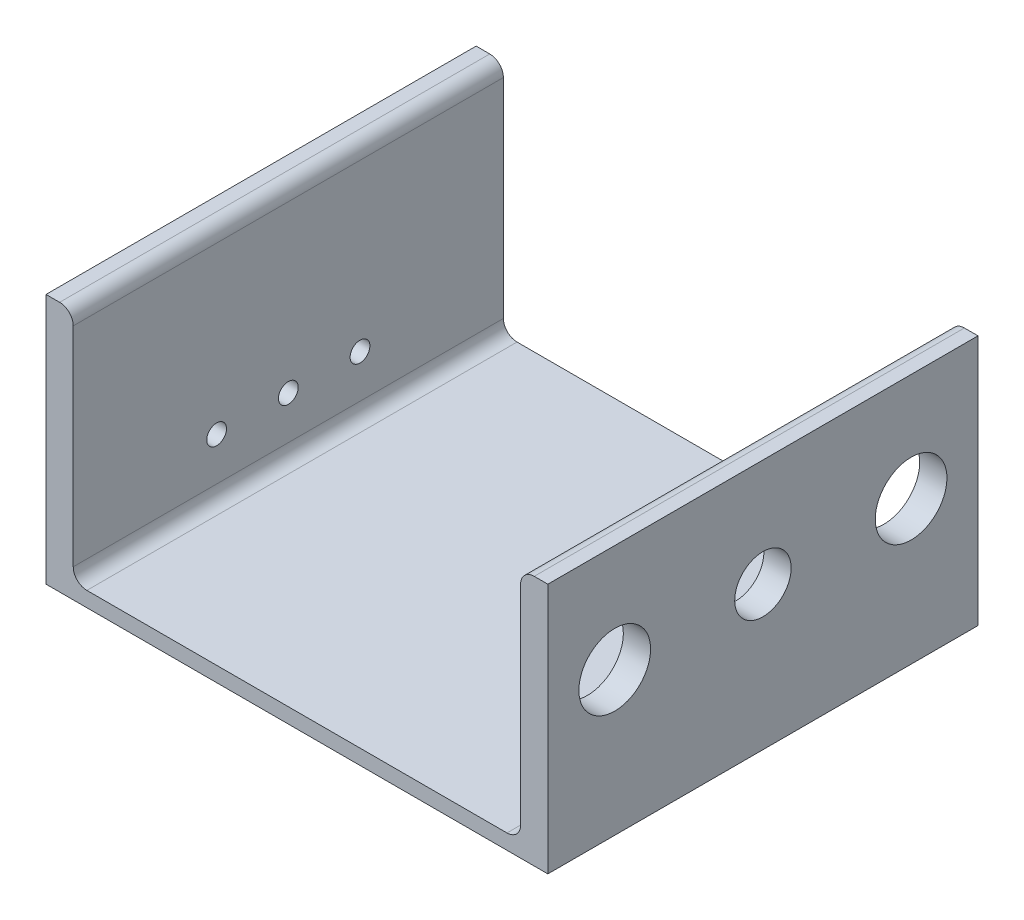
ISO-10303-21;
HEADER;
FILE_DESCRIPTION(('STEP AP214'),'2;1');
FILE_NAME('part.step','',(''),(''),'','','');
FILE_SCHEMA(('AUTOMOTIVE_DESIGN { 1 0 10303 214 1 1 1 1 }'));
ENDSEC;
DATA;
#1=APPLICATION_CONTEXT('core data for automotive mechanical design processes');
#2=APPLICATION_PROTOCOL_DEFINITION('international standard','automotive_design',2000,#1);
#3=PRODUCT_CONTEXT('',#1,'mechanical');
#4=PRODUCT('Part','Part','',(#3));
#5=PRODUCT_RELATED_PRODUCT_CATEGORY('part','',(#4));
#6=PRODUCT_DEFINITION_FORMATION('','',#4);
#7=PRODUCT_DEFINITION_CONTEXT('part definition',#1,'design');
#8=PRODUCT_DEFINITION('design','',#6,#7);
#9=PRODUCT_DEFINITION_SHAPE('','',#8);
#10=(LENGTH_UNIT() NAMED_UNIT(*) SI_UNIT(.MILLI.,.METRE.));
#11=(NAMED_UNIT(*) PLANE_ANGLE_UNIT() SI_UNIT($,.RADIAN.));
#12=(NAMED_UNIT(*) SI_UNIT($,.STERADIAN.) SOLID_ANGLE_UNIT());
#13=UNCERTAINTY_MEASURE_WITH_UNIT(LENGTH_MEASURE(1.E-05),#10,'distance_accuracy_value','');
#14=(GEOMETRIC_REPRESENTATION_CONTEXT(3) GLOBAL_UNCERTAINTY_ASSIGNED_CONTEXT((#13)) GLOBAL_UNIT_ASSIGNED_CONTEXT((#10,
#11,#12)) REPRESENTATION_CONTEXT('',''));
#15=CARTESIAN_POINT('',(0.,0.,0.));
#16=DIRECTION('',(0.,0.,1.));
#17=DIRECTION('',(1.,0.,0.));
#18=AXIS2_PLACEMENT_3D('',#15,#16,#17);
#19=CARTESIAN_POINT('',(-79.248,5.33399999999998,76.2));
#20=DIRECTION('',(-1.,0.,0.));
#21=DIRECTION('',(0.,-1.,0.));
#22=AXIS2_PLACEMENT_3D('',#19,#20,#21);
#23=PLANE('',#22);
#24=CARTESIAN_POINT('',(-79.248,25.4,25.4));
#25=DIRECTION('',(-1.,0.,0.));
#26=DIRECTION('',(0.,-1.,0.));
#27=AXIS2_PLACEMENT_3D('',#24,#25,#26);
#28=CIRCLE('',#27,3.5);
#29=CARTESIAN_POINT('',(-79.248,21.9,25.4));
#30=VERTEX_POINT('',#29);
#31=EDGE_CURVE('E317',#30,#30,#28,.F.);
#32=ORIENTED_EDGE('',*,*,#31,.F.);
#33=EDGE_LOOP('',(#32));
#34=FACE_BOUND('',#33,.T.);
#35=CARTESIAN_POINT('',(-79.248,25.4,-25.4));
#36=DIRECTION('',(-1.,0.,0.));
#37=DIRECTION('',(0.,-1.,0.));
#38=AXIS2_PLACEMENT_3D('',#35,#36,#37);
#39=CIRCLE('',#38,3.5);
#40=CARTESIAN_POINT('',(-79.248,21.9,-25.4));
#41=VERTEX_POINT('',#40);
#42=EDGE_CURVE('E316',#41,#41,#39,.F.);
#43=ORIENTED_EDGE('',*,*,#42,.F.);
#44=EDGE_LOOP('',(#43));
#45=FACE_BOUND('',#44,.T.);
#46=CARTESIAN_POINT('',(-79.248,25.4,0.));
#47=DIRECTION('',(-1.,0.,0.));
#48=DIRECTION('',(0.,-1.,0.));
#49=AXIS2_PLACEMENT_3D('',#46,#47,#48);
#50=CIRCLE('',#49,3.5);
#51=CARTESIAN_POINT('',(-79.248,21.9,0.));
#52=VERTEX_POINT('',#51);
#53=EDGE_CURVE('E294',#52,#52,#50,.F.);
#54=ORIENTED_EDGE('',*,*,#53,.F.);
#55=EDGE_LOOP('',(#54));
#56=FACE_BOUND('',#55,.T.);
#57=DIRECTION('',(0.,1.,0.));
#58=VECTOR('',#57,1.);
#59=CARTESIAN_POINT('',(-79.248,5.33399999999998,76.2));
#60=LINE('',#59,#58);
#61=CARTESIAN_POINT('',(-79.248,10.16,76.2));
#62=VERTEX_POINT('',#61);
#63=CARTESIAN_POINT('',(-79.248,84.074,76.2));
#64=VERTEX_POINT('',#63);
#65=EDGE_CURVE('E142',#62,#64,#60,.T.);
#66=ORIENTED_EDGE('',*,*,#65,.F.);
#67=DIRECTION('',(0.,0.,-1.));
#68=VECTOR('',#67,1.);
#69=CARTESIAN_POINT('',(-79.248,10.16,-76.2));
#70=LINE('',#69,#68);
#71=CARTESIAN_POINT('',(-79.248,10.16,-76.2));
#72=VERTEX_POINT('',#71);
#73=EDGE_CURVE('E218',#62,#72,#70,.T.);
#74=ORIENTED_EDGE('',*,*,#73,.T.);
#75=DIRECTION('',(0.,1.,0.));
#76=VECTOR('',#75,1.);
#77=CARTESIAN_POINT('',(-79.248,5.33399999999998,-76.2));
#78=LINE('',#77,#76);
#79=CARTESIAN_POINT('',(-79.248,84.074,-76.2));
#80=VERTEX_POINT('',#79);
#81=EDGE_CURVE('E180',#72,#80,#78,.T.);
#82=ORIENTED_EDGE('',*,*,#81,.T.);
#83=DIRECTION('',(0.,0.,-1.));
#84=VECTOR('',#83,1.);
#85=CARTESIAN_POINT('',(-79.248,84.074,76.2));
#86=LINE('',#85,#84);
#87=EDGE_CURVE('E152',#80,#64,#86,.F.);
#88=ORIENTED_EDGE('',*,*,#87,.T.);
#89=EDGE_LOOP('',(#66,#74,#82,#88));
#90=FACE_BOUND('',#89,.T.);
#91=ADVANCED_FACE('F43',(#34,#45,#56,#90),#23,.F.);
#92=CARTESIAN_POINT('',(-79.248,88.9,76.2));
#93=DIRECTION('',(0.,-1.,0.));
#94=DIRECTION('',(0.,0.,-1.));
#95=AXIS2_PLACEMENT_3D('',#92,#93,#94);
#96=PLANE('',#95);
#97=DIRECTION('',(-1.,0.,0.));
#98=VECTOR('',#97,1.);
#99=CARTESIAN_POINT('',(-79.248,88.9,76.2));
#100=LINE('',#99,#98);
#101=CARTESIAN_POINT('',(-84.074,88.9,76.2));
#102=VERTEX_POINT('',#101);
#103=CARTESIAN_POINT('',(-88.9,88.9,76.2));
#104=VERTEX_POINT('',#103);
#105=EDGE_CURVE('E132',#102,#104,#100,.T.);
#106=ORIENTED_EDGE('',*,*,#105,.F.);
#107=DIRECTION('',(0.,0.,-1.));
#108=VECTOR('',#107,1.);
#109=CARTESIAN_POINT('',(-84.074,88.9,76.2));
#110=LINE('',#109,#108);
#111=CARTESIAN_POINT('',(-84.074,88.9,-76.2));
#112=VERTEX_POINT('',#111);
#113=EDGE_CURVE('E249',#102,#112,#110,.T.);
#114=ORIENTED_EDGE('',*,*,#113,.T.);
#115=DIRECTION('',(-1.,0.,0.));
#116=VECTOR('',#115,1.);
#117=CARTESIAN_POINT('',(-79.248,88.9,-76.2));
#118=LINE('',#117,#116);
#119=CARTESIAN_POINT('',(-88.9,88.9,-76.2));
#120=VERTEX_POINT('',#119);
#121=EDGE_CURVE('E148',#112,#120,#118,.T.);
#122=ORIENTED_EDGE('',*,*,#121,.T.);
#123=DIRECTION('',(0.,0.,-1.));
#124=VECTOR('',#123,1.);
#125=CARTESIAN_POINT('',(-88.9,88.9,76.2));
#126=LINE('',#125,#124);
#127=EDGE_CURVE('E145',#104,#120,#126,.T.);
#128=ORIENTED_EDGE('',*,*,#127,.F.);
#129=EDGE_LOOP('',(#106,#114,#122,#128));
#130=FACE_BOUND('',#129,.T.);
#131=ADVANCED_FACE('F146',(#130),#96,.F.);
#132=CARTESIAN_POINT('',(-88.9,88.9,76.2));
#133=DIRECTION('',(1.,0.,0.));
#134=DIRECTION('',(0.,1.,0.));
#135=AXIS2_PLACEMENT_3D('',#132,#133,#134);
#136=PLANE('',#135);
#137=CARTESIAN_POINT('',(-88.9,25.4,25.4));
#138=DIRECTION('',(-1.,0.,0.));
#139=DIRECTION('',(0.,1.,0.));
#140=AXIS2_PLACEMENT_3D('',#137,#138,#139);
#141=CIRCLE('',#140,3.5);
#142=CARTESIAN_POINT('',(-88.9,28.9,25.4));
#143=VERTEX_POINT('',#142);
#144=EDGE_CURVE('E322',#143,#143,#141,.T.);
#145=ORIENTED_EDGE('',*,*,#144,.F.);
#146=EDGE_LOOP('',(#145));
#147=FACE_BOUND('',#146,.T.);
#148=CARTESIAN_POINT('',(-88.9,25.4,-25.4));
#149=DIRECTION('',(-1.,0.,0.));
#150=DIRECTION('',(0.,-1.,0.));
#151=AXIS2_PLACEMENT_3D('',#148,#149,#150);
#152=CIRCLE('',#151,3.5);
#153=CARTESIAN_POINT('',(-88.9,21.9,-25.4));
#154=VERTEX_POINT('',#153);
#155=EDGE_CURVE('E321',#154,#154,#152,.T.);
#156=ORIENTED_EDGE('',*,*,#155,.F.);
#157=EDGE_LOOP('',(#156));
#158=FACE_BOUND('',#157,.T.);
#159=CARTESIAN_POINT('',(-88.9,25.4,0.));
#160=DIRECTION('',(-1.,0.,0.));
#161=DIRECTION('',(0.,-1.,0.));
#162=AXIS2_PLACEMENT_3D('',#159,#160,#161);
#163=CIRCLE('',#162,3.5);
#164=CARTESIAN_POINT('',(-88.9,21.9,0.));
#165=VERTEX_POINT('',#164);
#166=EDGE_CURVE('E312',#165,#165,#163,.T.);
#167=ORIENTED_EDGE('',*,*,#166,.F.);
#168=EDGE_LOOP('',(#167));
#169=FACE_BOUND('',#168,.T.);
#170=DIRECTION('',(0.,-1.,0.));
#171=VECTOR('',#170,1.);
#172=CARTESIAN_POINT('',(-88.9,88.9,-76.2));
#173=LINE('',#172,#171);
#174=CARTESIAN_POINT('',(-88.9,0.,-76.2));
#175=VERTEX_POINT('',#174);
#176=EDGE_CURVE('E187',#120,#175,#173,.T.);
#177=ORIENTED_EDGE('',*,*,#176,.T.);
#178=DIRECTION('',(0.,0.,-1.));
#179=VECTOR('',#178,1.);
#180=CARTESIAN_POINT('',(-88.9,0.,76.2));
#181=LINE('',#180,#179);
#182=CARTESIAN_POINT('',(-88.9,0.,76.2));
#183=VERTEX_POINT('',#182);
#184=EDGE_CURVE('E153',#183,#175,#181,.T.);
#185=ORIENTED_EDGE('',*,*,#184,.F.);
#186=DIRECTION('',(0.,-1.,0.));
#187=VECTOR('',#186,1.);
#188=CARTESIAN_POINT('',(-88.9,88.9,76.2));
#189=LINE('',#188,#187);
#190=EDGE_CURVE('E136',#104,#183,#189,.T.);
#191=ORIENTED_EDGE('',*,*,#190,.F.);
#192=ORIENTED_EDGE('',*,*,#127,.T.);
#193=EDGE_LOOP('',(#177,#185,#191,#192));
#194=FACE_BOUND('',#193,.T.);
#195=ADVANCED_FACE('F155',(#147,#158,#169,#194),#136,.F.);
#196=CARTESIAN_POINT('',(-88.9,0.,76.2));
#197=DIRECTION('',(0.,1.,0.));
#198=DIRECTION('',(0.,0.,1.));
#199=AXIS2_PLACEMENT_3D('',#196,#197,#198);
#200=PLANE('',#199);
#201=DIRECTION('',(1.,0.,0.));
#202=VECTOR('',#201,1.);
#203=CARTESIAN_POINT('',(-88.9,0.,-76.2));
#204=LINE('',#203,#202);
#205=CARTESIAN_POINT('',(88.9,0.,-76.2));
#206=VERTEX_POINT('',#205);
#207=EDGE_CURVE('E190',#175,#206,#204,.T.);
#208=ORIENTED_EDGE('',*,*,#207,.T.);
#209=DIRECTION('',(0.,0.,-1.));
#210=VECTOR('',#209,1.);
#211=CARTESIAN_POINT('',(88.9,0.,76.2));
#212=LINE('',#211,#210);
#213=CARTESIAN_POINT('',(88.9,0.,76.2));
#214=VERTEX_POINT('',#213);
#215=EDGE_CURVE('E210',#214,#206,#212,.T.);
#216=ORIENTED_EDGE('',*,*,#215,.F.);
#217=DIRECTION('',(1.,0.,0.));
#218=VECTOR('',#217,1.);
#219=CARTESIAN_POINT('',(-88.9,0.,76.2));
#220=LINE('',#219,#218);
#221=EDGE_CURVE('E159',#183,#214,#220,.T.);
#222=ORIENTED_EDGE('',*,*,#221,.F.);
#223=ORIENTED_EDGE('',*,*,#184,.T.);
#224=EDGE_LOOP('',(#208,#216,#222,#223));
#225=FACE_BOUND('',#224,.T.);
#226=ADVANCED_FACE('F337',(#225),#200,.F.);
#227=CARTESIAN_POINT('',(88.9,0.,76.2));
#228=DIRECTION('',(-1.,0.,0.));
#229=DIRECTION('',(0.,-1.,0.));
#230=AXIS2_PLACEMENT_3D('',#227,#228,#229);
#231=PLANE('',#230);
#232=CARTESIAN_POINT('',(88.9,50.8,-52.5));
#233=DIRECTION('',(1.,0.,0.));
#234=DIRECTION('',(0.,1.,0.));
#235=AXIS2_PLACEMENT_3D('',#232,#233,#234);
#236=CIRCLE('',#235,12.7);
#237=CARTESIAN_POINT('',(88.9,63.5,-52.5));
#238=VERTEX_POINT('',#237);
#239=EDGE_CURVE('E299',#238,#238,#236,.T.);
#240=ORIENTED_EDGE('',*,*,#239,.F.);
#241=EDGE_LOOP('',(#240));
#242=FACE_BOUND('',#241,.T.);
#243=CARTESIAN_POINT('',(88.9,50.8,52.5));
#244=DIRECTION('',(1.,0.,0.));
#245=DIRECTION('',(0.,-1.,0.));
#246=AXIS2_PLACEMENT_3D('',#243,#244,#245);
#247=CIRCLE('',#246,12.7);
#248=CARTESIAN_POINT('',(88.9,38.1,52.5));
#249=VERTEX_POINT('',#248);
#250=EDGE_CURVE('E289',#249,#249,#247,.T.);
#251=ORIENTED_EDGE('',*,*,#250,.F.);
#252=EDGE_LOOP('',(#251));
#253=FACE_BOUND('',#252,.T.);
#254=CARTESIAN_POINT('',(88.9,50.8,0.));
#255=DIRECTION('',(1.,0.,0.));
#256=DIRECTION('',(0.,1.,0.));
#257=AXIS2_PLACEMENT_3D('',#254,#255,#256);
#258=CIRCLE('',#257,10.);
#259=CARTESIAN_POINT('',(88.9,60.8,0.));
#260=VERTEX_POINT('',#259);
#261=EDGE_CURVE('E290',#260,#260,#258,.T.);
#262=ORIENTED_EDGE('',*,*,#261,.F.);
#263=EDGE_LOOP('',(#262));
#264=FACE_BOUND('',#263,.T.);
#265=DIRECTION('',(0.,1.,0.));
#266=VECTOR('',#265,1.);
#267=CARTESIAN_POINT('',(88.9,0.,-76.2));
#268=LINE('',#267,#266);
#269=CARTESIAN_POINT('',(88.9,88.9,-76.2));
#270=VERTEX_POINT('',#269);
#271=EDGE_CURVE('E193',#206,#270,#268,.T.);
#272=ORIENTED_EDGE('',*,*,#271,.T.);
#273=DIRECTION('',(0.,0.,-1.));
#274=VECTOR('',#273,1.);
#275=CARTESIAN_POINT('',(88.9,88.9,76.2));
#276=LINE('',#275,#274);
#277=CARTESIAN_POINT('',(88.9,88.9,76.2));
#278=VERTEX_POINT('',#277);
#279=EDGE_CURVE('E179',#278,#270,#276,.T.);
#280=ORIENTED_EDGE('',*,*,#279,.F.);
#281=DIRECTION('',(0.,1.,0.));
#282=VECTOR('',#281,1.);
#283=CARTESIAN_POINT('',(88.9,0.,76.2));
#284=LINE('',#283,#282);
#285=EDGE_CURVE('E162',#214,#278,#284,.T.);
#286=ORIENTED_EDGE('',*,*,#285,.F.);
#287=ORIENTED_EDGE('',*,*,#215,.T.);
#288=EDGE_LOOP('',(#272,#280,#286,#287));
#289=FACE_BOUND('',#288,.T.);
#290=ADVANCED_FACE('F388',(#242,#253,#264,#289),#231,.F.);
#291=CARTESIAN_POINT('',(88.9,88.9,76.2));
#292=DIRECTION('',(0.,-1.,0.));
#293=DIRECTION('',(0.,0.,-1.));
#294=AXIS2_PLACEMENT_3D('',#291,#292,#293);
#295=PLANE('',#294);
#296=DIRECTION('',(-1.,0.,0.));
#297=VECTOR('',#296,1.);
#298=CARTESIAN_POINT('',(88.9,88.9,-76.2));
#299=LINE('',#298,#297);
#300=CARTESIAN_POINT('',(84.074,88.9,-76.2));
#301=VERTEX_POINT('',#300);
#302=EDGE_CURVE('E196',#270,#301,#299,.T.);
#303=ORIENTED_EDGE('',*,*,#302,.T.);
#304=DIRECTION('',(0.,0.,-1.));
#305=VECTOR('',#304,1.);
#306=CARTESIAN_POINT('',(84.074,88.9,76.2));
#307=LINE('',#306,#305);
#308=CARTESIAN_POINT('',(84.074,88.9,76.2));
#309=VERTEX_POINT('',#308);
#310=EDGE_CURVE('E67',#301,#309,#307,.F.);
#311=ORIENTED_EDGE('',*,*,#310,.T.);
#312=DIRECTION('',(-1.,0.,0.));
#313=VECTOR('',#312,1.);
#314=CARTESIAN_POINT('',(88.9,88.9,76.2));
#315=LINE('',#314,#313);
#316=EDGE_CURVE('E168',#278,#309,#315,.T.);
#317=ORIENTED_EDGE('',*,*,#316,.F.);
#318=ORIENTED_EDGE('',*,*,#279,.T.);
#319=EDGE_LOOP('',(#303,#311,#317,#318));
#320=FACE_BOUND('',#319,.T.);
#321=ADVANCED_FACE('F383',(#320),#295,.F.);
#322=CARTESIAN_POINT('',(79.248,88.9,76.2));
#323=DIRECTION('',(1.,0.,0.));
#324=DIRECTION('',(0.,1.,0.));
#325=AXIS2_PLACEMENT_3D('',#322,#323,#324);
#326=PLANE('',#325);
#327=CARTESIAN_POINT('',(79.248,50.8,-52.5));
#328=DIRECTION('',(1.,0.,0.));
#329=DIRECTION('',(0.,1.,0.));
#330=AXIS2_PLACEMENT_3D('',#327,#328,#329);
#331=CIRCLE('',#330,12.7);
#332=CARTESIAN_POINT('',(79.248,63.5,-52.5));
#333=VERTEX_POINT('',#332);
#334=EDGE_CURVE('E184',#333,#333,#331,.F.);
#335=ORIENTED_EDGE('',*,*,#334,.F.);
#336=EDGE_LOOP('',(#335));
#337=FACE_BOUND('',#336,.T.);
#338=CARTESIAN_POINT('',(79.248,50.8,52.5));
#339=DIRECTION('',(1.,0.,0.));
#340=DIRECTION('',(0.,1.,0.));
#341=AXIS2_PLACEMENT_3D('',#338,#339,#340);
#342=CIRCLE('',#341,12.7);
#343=CARTESIAN_POINT('',(79.248,63.5,52.5));
#344=VERTEX_POINT('',#343);
#345=EDGE_CURVE('E295',#344,#344,#342,.F.);
#346=ORIENTED_EDGE('',*,*,#345,.F.);
#347=EDGE_LOOP('',(#346));
#348=FACE_BOUND('',#347,.T.);
#349=CARTESIAN_POINT('',(79.248,50.8,0.));
#350=DIRECTION('',(1.,0.,0.));
#351=DIRECTION('',(0.,1.,0.));
#352=AXIS2_PLACEMENT_3D('',#349,#350,#351);
#353=CIRCLE('',#352,10.);
#354=CARTESIAN_POINT('',(79.248,60.8,0.));
#355=VERTEX_POINT('',#354);
#356=EDGE_CURVE('E285',#355,#355,#353,.F.);
#357=ORIENTED_EDGE('',*,*,#356,.F.);
#358=EDGE_LOOP('',(#357));
#359=FACE_BOUND('',#358,.T.);
#360=DIRECTION('',(0.,-1.,0.));
#361=VECTOR('',#360,1.);
#362=CARTESIAN_POINT('',(79.248,88.9,-76.2));
#363=LINE('',#362,#361);
#364=CARTESIAN_POINT('',(79.248,84.074,-76.2));
#365=VERTEX_POINT('',#364);
#366=CARTESIAN_POINT('',(79.248,10.16,-76.2));
#367=VERTEX_POINT('',#366);
#368=EDGE_CURVE('E199',#365,#367,#363,.T.);
#369=ORIENTED_EDGE('',*,*,#368,.T.);
#370=DIRECTION('',(0.,0.,-1.));
#371=VECTOR('',#370,1.);
#372=CARTESIAN_POINT('',(79.248,10.16,76.2));
#373=LINE('',#372,#371);
#374=CARTESIAN_POINT('',(79.248,10.16,76.2));
#375=VERTEX_POINT('',#374);
#376=EDGE_CURVE('E233',#367,#375,#373,.F.);
#377=ORIENTED_EDGE('',*,*,#376,.T.);
#378=DIRECTION('',(0.,-1.,0.));
#379=VECTOR('',#378,1.);
#380=CARTESIAN_POINT('',(79.248,88.9,76.2));
#381=LINE('',#380,#379);
#382=CARTESIAN_POINT('',(79.248,84.074,76.2));
#383=VERTEX_POINT('',#382);
#384=EDGE_CURVE('E171',#383,#375,#381,.T.);
#385=ORIENTED_EDGE('',*,*,#384,.F.);
#386=DIRECTION('',(0.,0.,-1.));
#387=VECTOR('',#386,1.);
#388=CARTESIAN_POINT('',(79.248,84.074,76.2));
#389=LINE('',#388,#387);
#390=EDGE_CURVE('E229',#383,#365,#389,.T.);
#391=ORIENTED_EDGE('',*,*,#390,.T.);
#392=EDGE_LOOP('',(#369,#377,#385,#391));
#393=FACE_BOUND('',#392,.T.);
#394=ADVANCED_FACE('F266',(#337,#348,#359,#393),#326,.F.);
#395=CARTESIAN_POINT('',(79.248,5.33399999999998,76.2));
#396=DIRECTION('',(0.,-1.,0.));
#397=DIRECTION('',(0.,0.,-1.));
#398=AXIS2_PLACEMENT_3D('',#395,#396,#397);
#399=PLANE('',#398);
#400=DIRECTION('',(-1.,0.,0.));
#401=VECTOR('',#400,1.);
#402=CARTESIAN_POINT('',(79.248,5.33399999999998,-76.2));
#403=LINE('',#402,#401);
#404=CARTESIAN_POINT('',(74.422,5.33399999999998,-76.2));
#405=VERTEX_POINT('',#404);
#406=CARTESIAN_POINT('',(-74.422,5.33399999999998,-76.2));
#407=VERTEX_POINT('',#406);
#408=EDGE_CURVE('E203',#405,#407,#403,.T.);
#409=ORIENTED_EDGE('',*,*,#408,.T.);
#410=DIRECTION('',(0.,0.,-1.));
#411=VECTOR('',#410,1.);
#412=CARTESIAN_POINT('',(-74.422,5.33399999999998,76.2));
#413=LINE('',#412,#411);
#414=CARTESIAN_POINT('',(-74.422,5.33399999999998,76.2));
#415=VERTEX_POINT('',#414);
#416=EDGE_CURVE('E226',#407,#415,#413,.F.);
#417=ORIENTED_EDGE('',*,*,#416,.T.);
#418=DIRECTION('',(-1.,0.,0.));
#419=VECTOR('',#418,1.);
#420=CARTESIAN_POINT('',(79.248,5.33399999999998,76.2));
#421=LINE('',#420,#419);
#422=CARTESIAN_POINT('',(74.422,5.33399999999998,76.2));
#423=VERTEX_POINT('',#422);
#424=EDGE_CURVE('E175',#423,#415,#421,.T.);
#425=ORIENTED_EDGE('',*,*,#424,.F.);
#426=DIRECTION('',(0.,0.,-1.));
#427=VECTOR('',#426,1.);
#428=CARTESIAN_POINT('',(74.422,5.33399999999998,-76.2));
#429=LINE('',#428,#427);
#430=EDGE_CURVE('E222',#423,#405,#429,.T.);
#431=ORIENTED_EDGE('',*,*,#430,.T.);
#432=EDGE_LOOP('',(#409,#417,#425,#431));
#433=FACE_BOUND('',#432,.T.);
#434=ADVANCED_FACE('F274',(#433),#399,.F.);
#435=CARTESIAN_POINT('',(-79.248,88.9,76.2));
#436=DIRECTION('',(0.,0.,1.));
#437=DIRECTION('',(1.,0.,0.));
#438=AXIS2_PLACEMENT_3D('',#435,#436,#437);
#439=PLANE('',#438);
#440=ORIENTED_EDGE('',*,*,#316,.T.);
#441=CARTESIAN_POINT('',(84.074,84.074,76.2));
#442=DIRECTION('',(0.,0.,1.));
#443=DIRECTION('',(1.,0.,0.));
#444=AXIS2_PLACEMENT_3D('',#441,#442,#443);
#445=CIRCLE('',#444,4.826);
#446=EDGE_CURVE('E246',#309,#383,#445,.T.);
#447=ORIENTED_EDGE('',*,*,#446,.T.);
#448=ORIENTED_EDGE('',*,*,#384,.T.);
#449=CARTESIAN_POINT('',(74.422,10.16,76.2));
#450=DIRECTION('',(0.,0.,1.));
#451=DIRECTION('',(1.,0.,0.));
#452=AXIS2_PLACEMENT_3D('',#449,#450,#451);
#453=CIRCLE('',#452,4.826);
#454=EDGE_CURVE('E11',#375,#423,#453,.F.);
#455=ORIENTED_EDGE('',*,*,#454,.T.);
#456=ORIENTED_EDGE('',*,*,#424,.T.);
#457=CARTESIAN_POINT('',(-74.422,10.16,76.2));
#458=DIRECTION('',(0.,0.,1.));
#459=DIRECTION('',(1.,0.,0.));
#460=AXIS2_PLACEMENT_3D('',#457,#458,#459);
#461=CIRCLE('',#460,4.826);
#462=EDGE_CURVE('E255',#415,#62,#461,.F.);
#463=ORIENTED_EDGE('',*,*,#462,.T.);
#464=ORIENTED_EDGE('',*,*,#65,.T.);
#465=CARTESIAN_POINT('',(-84.074,84.074,76.2));
#466=DIRECTION('',(0.,0.,1.));
#467=DIRECTION('',(1.,0.,0.));
#468=AXIS2_PLACEMENT_3D('',#465,#466,#467);
#469=CIRCLE('',#468,4.826);
#470=EDGE_CURVE('E59',#64,#102,#469,.T.);
#471=ORIENTED_EDGE('',*,*,#470,.T.);
#472=ORIENTED_EDGE('',*,*,#105,.T.);
#473=ORIENTED_EDGE('',*,*,#190,.T.);
#474=ORIENTED_EDGE('',*,*,#221,.T.);
#475=ORIENTED_EDGE('',*,*,#285,.T.);
#476=EDGE_LOOP('',(#440,#447,#448,#455,#456,#463,#464,#471,#472,#473,#474,#475));
#477=FACE_BOUND('',#476,.T.);
#478=ADVANCED_FACE('F134',(#477),#439,.T.);
#479=CARTESIAN_POINT('',(-79.248,88.9,-76.2));
#480=DIRECTION('',(0.,0.,1.));
#481=DIRECTION('',(1.,0.,0.));
#482=AXIS2_PLACEMENT_3D('',#479,#480,#481);
#483=PLANE('',#482);
#484=ORIENTED_EDGE('',*,*,#368,.F.);
#485=CARTESIAN_POINT('',(84.074,84.074,-76.2));
#486=DIRECTION('',(0.,0.,1.));
#487=DIRECTION('',(1.,0.,0.));
#488=AXIS2_PLACEMENT_3D('',#485,#486,#487);
#489=CIRCLE('',#488,4.826);
#490=EDGE_CURVE('E239',#365,#301,#489,.F.);
#491=ORIENTED_EDGE('',*,*,#490,.T.);
#492=ORIENTED_EDGE('',*,*,#302,.F.);
#493=ORIENTED_EDGE('',*,*,#271,.F.);
#494=ORIENTED_EDGE('',*,*,#207,.F.);
#495=ORIENTED_EDGE('',*,*,#176,.F.);
#496=ORIENTED_EDGE('',*,*,#121,.F.);
#497=CARTESIAN_POINT('',(-84.074,84.074,-76.2));
#498=DIRECTION('',(0.,0.,1.));
#499=DIRECTION('',(1.,0.,0.));
#500=AXIS2_PLACEMENT_3D('',#497,#498,#499);
#501=CIRCLE('',#500,4.826);
#502=EDGE_CURVE('E236',#112,#80,#501,.F.);
#503=ORIENTED_EDGE('',*,*,#502,.T.);
#504=ORIENTED_EDGE('',*,*,#81,.F.);
#505=CARTESIAN_POINT('',(-74.422,10.16,-76.2));
#506=DIRECTION('',(0.,0.,1.));
#507=DIRECTION('',(1.,0.,0.));
#508=AXIS2_PLACEMENT_3D('',#505,#506,#507);
#509=CIRCLE('',#508,4.826);
#510=EDGE_CURVE('E252',#72,#407,#509,.T.);
#511=ORIENTED_EDGE('',*,*,#510,.T.);
#512=ORIENTED_EDGE('',*,*,#408,.F.);
#513=CARTESIAN_POINT('',(74.422,10.16,-76.2));
#514=DIRECTION('',(0.,0.,1.));
#515=DIRECTION('',(1.,0.,0.));
#516=AXIS2_PLACEMENT_3D('',#513,#514,#515);
#517=CIRCLE('',#516,4.826);
#518=EDGE_CURVE('E52',#405,#367,#517,.T.);
#519=ORIENTED_EDGE('',*,*,#518,.T.);
#520=EDGE_LOOP('',(#484,#491,#492,#493,#494,#495,#496,#503,#504,#511,#512,#519));
#521=FACE_BOUND('',#520,.T.);
#522=ADVANCED_FACE('F261',(#521),#483,.F.);
#523=CARTESIAN_POINT('',(-74.422,10.16,76.2));
#524=DIRECTION('',(0.,0.,1.));
#525=DIRECTION('',(1.,0.,0.));
#526=AXIS2_PLACEMENT_3D('',#523,#524,#525);
#527=CYLINDRICAL_SURFACE('',#526,4.826);
#528=ORIENTED_EDGE('',*,*,#462,.F.);
#529=ORIENTED_EDGE('',*,*,#416,.F.);
#530=ORIENTED_EDGE('',*,*,#510,.F.);
#531=ORIENTED_EDGE('',*,*,#73,.F.);
#532=EDGE_LOOP('',(#528,#529,#530,#531));
#533=FACE_BOUND('',#532,.T.);
#534=ADVANCED_FACE('F277',(#533),#527,.F.);
#535=CARTESIAN_POINT('',(74.422,10.16,76.2));
#536=DIRECTION('',(0.,0.,1.));
#537=DIRECTION('',(1.,0.,0.));
#538=AXIS2_PLACEMENT_3D('',#535,#536,#537);
#539=CYLINDRICAL_SURFACE('',#538,4.826);
#540=ORIENTED_EDGE('',*,*,#454,.F.);
#541=ORIENTED_EDGE('',*,*,#376,.F.);
#542=ORIENTED_EDGE('',*,*,#518,.F.);
#543=ORIENTED_EDGE('',*,*,#430,.F.);
#544=EDGE_LOOP('',(#540,#541,#542,#543));
#545=FACE_BOUND('',#544,.T.);
#546=ADVANCED_FACE('F270',(#545),#539,.F.);
#547=CARTESIAN_POINT('',(84.074,84.074,76.2));
#548=DIRECTION('',(0.,0.,-1.));
#549=DIRECTION('',(-1.,0.,0.));
#550=AXIS2_PLACEMENT_3D('',#547,#548,#549);
#551=CYLINDRICAL_SURFACE('',#550,4.826);
#552=ORIENTED_EDGE('',*,*,#446,.F.);
#553=ORIENTED_EDGE('',*,*,#310,.F.);
#554=ORIENTED_EDGE('',*,*,#490,.F.);
#555=ORIENTED_EDGE('',*,*,#390,.F.);
#556=EDGE_LOOP('',(#552,#553,#554,#555));
#557=FACE_BOUND('',#556,.T.);
#558=ADVANCED_FACE('F372',(#557),#551,.T.);
#559=CARTESIAN_POINT('',(-84.074,84.074,76.2));
#560=DIRECTION('',(0.,0.,-1.));
#561=DIRECTION('',(-1.,0.,0.));
#562=AXIS2_PLACEMENT_3D('',#559,#560,#561);
#563=CYLINDRICAL_SURFACE('',#562,4.826);
#564=ORIENTED_EDGE('',*,*,#470,.F.);
#565=ORIENTED_EDGE('',*,*,#87,.F.);
#566=ORIENTED_EDGE('',*,*,#502,.F.);
#567=ORIENTED_EDGE('',*,*,#113,.F.);
#568=EDGE_LOOP('',(#564,#565,#566,#567));
#569=FACE_BOUND('',#568,.T.);
#570=ADVANCED_FACE('F45',(#569),#563,.T.);
#571=CARTESIAN_POINT('',(43.3269755157234,50.8,0.));
#572=DIRECTION('',(1.,0.,0.));
#573=DIRECTION('',(0.,1.,0.));
#574=AXIS2_PLACEMENT_3D('',#571,#572,#573);
#575=CYLINDRICAL_SURFACE('',#574,10.);
#576=ORIENTED_EDGE('',*,*,#356,.T.);
#577=EDGE_LOOP('',(#576));
#578=FACE_BOUND('',#577,.T.);
#579=ORIENTED_EDGE('',*,*,#261,.T.);
#580=EDGE_LOOP('',(#579));
#581=FACE_BOUND('',#580,.T.);
#582=ADVANCED_FACE('F378',(#578,#581),#575,.F.);
#583=CARTESIAN_POINT('',(43.3269755157234,50.8,52.5));
#584=DIRECTION('',(1.,0.,0.));
#585=DIRECTION('',(0.,1.,0.));
#586=AXIS2_PLACEMENT_3D('',#583,#584,#585);
#587=CYLINDRICAL_SURFACE('',#586,12.7);
#588=ORIENTED_EDGE('',*,*,#345,.T.);
#589=EDGE_LOOP('',(#588));
#590=FACE_BOUND('',#589,.T.);
#591=ORIENTED_EDGE('',*,*,#250,.T.);
#592=EDGE_LOOP('',(#591));
#593=FACE_BOUND('',#592,.T.);
#594=ADVANCED_FACE('F354',(#590,#593),#587,.F.);
#595=CARTESIAN_POINT('',(43.3269755157234,50.8,-52.5));
#596=DIRECTION('',(1.,0.,0.));
#597=DIRECTION('',(0.,1.,0.));
#598=AXIS2_PLACEMENT_3D('',#595,#596,#597);
#599=CYLINDRICAL_SURFACE('',#598,12.7);
#600=ORIENTED_EDGE('',*,*,#334,.T.);
#601=EDGE_LOOP('',(#600));
#602=FACE_BOUND('',#601,.T.);
#603=ORIENTED_EDGE('',*,*,#239,.T.);
#604=EDGE_LOOP('',(#603));
#605=FACE_BOUND('',#604,.T.);
#606=ADVANCED_FACE('F344',(#602,#605),#599,.F.);
#607=CARTESIAN_POINT('',(-69.3485050633883,25.4,0.));
#608=DIRECTION('',(-1.,0.,0.));
#609=DIRECTION('',(0.,-1.,0.));
#610=AXIS2_PLACEMENT_3D('',#607,#608,#609);
#611=CYLINDRICAL_SURFACE('',#610,3.5);
#612=ORIENTED_EDGE('',*,*,#53,.T.);
#613=EDGE_LOOP('',(#612));
#614=FACE_BOUND('',#613,.T.);
#615=ORIENTED_EDGE('',*,*,#166,.T.);
#616=EDGE_LOOP('',(#615));
#617=FACE_BOUND('',#616,.T.);
#618=ADVANCED_FACE('F342',(#614,#617),#611,.F.);
#619=CARTESIAN_POINT('',(-69.3485050633883,25.4,-25.4));
#620=DIRECTION('',(-1.,0.,0.));
#621=DIRECTION('',(0.,-1.,0.));
#622=AXIS2_PLACEMENT_3D('',#619,#620,#621);
#623=CYLINDRICAL_SURFACE('',#622,3.5);
#624=ORIENTED_EDGE('',*,*,#42,.T.);
#625=EDGE_LOOP('',(#624));
#626=FACE_BOUND('',#625,.T.);
#627=ORIENTED_EDGE('',*,*,#155,.T.);
#628=EDGE_LOOP('',(#627));
#629=FACE_BOUND('',#628,.T.);
#630=ADVANCED_FACE('F333',(#626,#629),#623,.F.);
#631=CARTESIAN_POINT('',(-69.3485050633883,25.4,25.4));
#632=DIRECTION('',(-1.,0.,0.));
#633=DIRECTION('',(0.,-1.,0.));
#634=AXIS2_PLACEMENT_3D('',#631,#632,#633);
#635=CYLINDRICAL_SURFACE('',#634,3.5);
#636=ORIENTED_EDGE('',*,*,#31,.T.);
#637=EDGE_LOOP('',(#636));
#638=FACE_BOUND('',#637,.T.);
#639=ORIENTED_EDGE('',*,*,#144,.T.);
#640=EDGE_LOOP('',(#639));
#641=FACE_BOUND('',#640,.T.);
#642=ADVANCED_FACE('F351',(#638,#641),#635,.F.);
#643=CLOSED_SHELL('',(#91,#131,#195,#226,#290,#321,#394,#434,#478,#522,#534,#546,#558,#570,#582,
#594,#606,#618,#630,#642));
#644=MANIFOLD_SOLID_BREP('B2',#643);
#645=ADVANCED_BREP_SHAPE_REPRESENTATION('',(#18,#644),#14);
#646=SHAPE_DEFINITION_REPRESENTATION(#9,#645);
ENDSEC;
END-ISO-10303-21;
